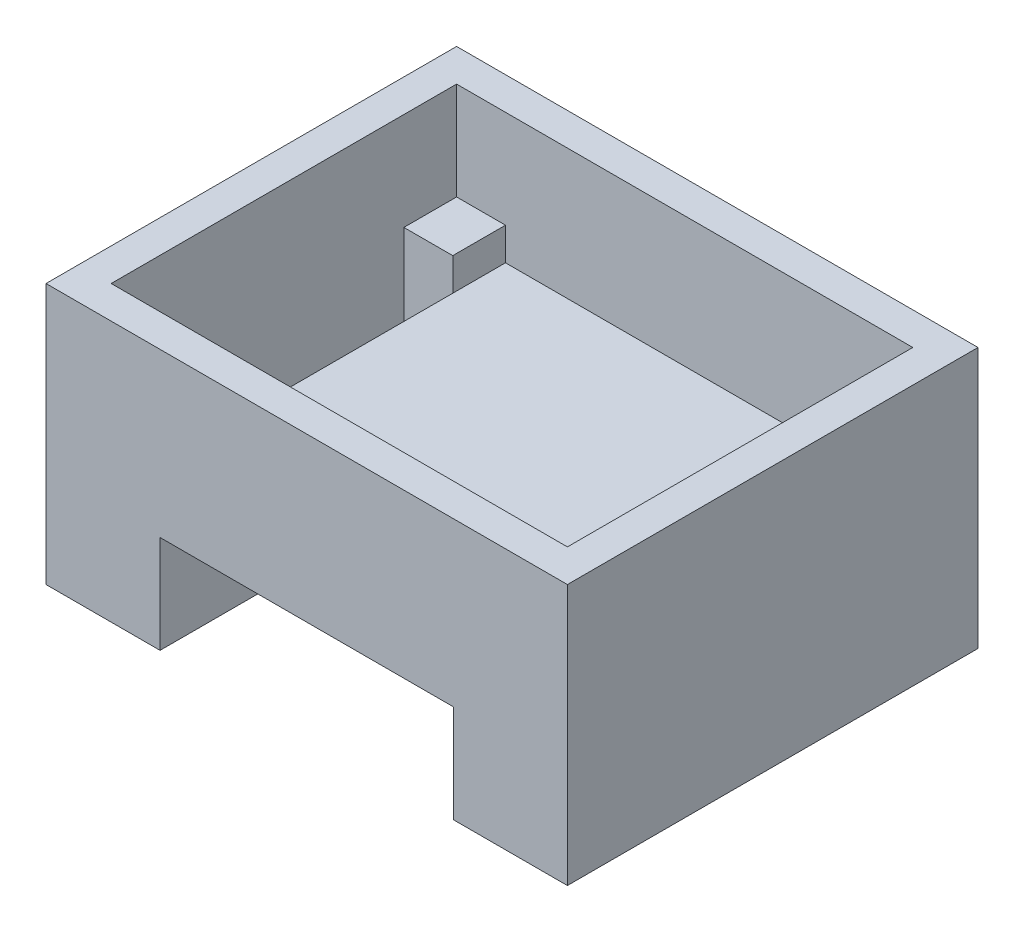
ISO-10303-21;
HEADER;
FILE_DESCRIPTION(('STEP AP214'),'2;1');
FILE_NAME('part.step','',(''),(''),'','','');
FILE_SCHEMA(('AUTOMOTIVE_DESIGN { 1 0 10303 214 1 1 1 1 }'));
ENDSEC;
DATA;
#1=APPLICATION_CONTEXT('core data for automotive mechanical design processes');
#2=APPLICATION_PROTOCOL_DEFINITION('international standard','automotive_design',2000,#1);
#3=PRODUCT_CONTEXT('',#1,'mechanical');
#4=PRODUCT('Part','Part','',(#3));
#5=PRODUCT_RELATED_PRODUCT_CATEGORY('part','',(#4));
#6=PRODUCT_DEFINITION_FORMATION('','',#4);
#7=PRODUCT_DEFINITION_CONTEXT('part definition',#1,'design');
#8=PRODUCT_DEFINITION('design','',#6,#7);
#9=PRODUCT_DEFINITION_SHAPE('','',#8);
#10=(LENGTH_UNIT() NAMED_UNIT(*) SI_UNIT(.MILLI.,.METRE.));
#11=(NAMED_UNIT(*) PLANE_ANGLE_UNIT() SI_UNIT($,.RADIAN.));
#12=(NAMED_UNIT(*) SI_UNIT($,.STERADIAN.) SOLID_ANGLE_UNIT());
#13=UNCERTAINTY_MEASURE_WITH_UNIT(LENGTH_MEASURE(1.E-05),#10,'distance_accuracy_value','');
#14=(GEOMETRIC_REPRESENTATION_CONTEXT(3) GLOBAL_UNCERTAINTY_ASSIGNED_CONTEXT((#13)) GLOBAL_UNIT_ASSIGNED_CONTEXT((#10,
#11,#12)) REPRESENTATION_CONTEXT('',''));
#15=CARTESIAN_POINT('',(0.,0.,0.));
#16=DIRECTION('',(0.,0.,1.));
#17=DIRECTION('',(1.,0.,0.));
#18=AXIS2_PLACEMENT_3D('',#15,#16,#17);
#19=CARTESIAN_POINT('',(-65.,10.,-111.));
#20=DIRECTION('',(0.,1.,0.));
#21=DIRECTION('',(0.,0.,1.));
#22=AXIS2_PLACEMENT_3D('',#19,#20,#21);
#23=PLANE('',#22);
#24=DIRECTION('',(0.,0.,-1.));
#25=VECTOR('',#24,1.);
#26=CARTESIAN_POINT('',(-70.,10.,-126.));
#27=LINE('',#26,#25);
#28=CARTESIAN_POINT('',(-70.,10.,-99.8196601125011));
#29=VERTEX_POINT('',#28);
#30=CARTESIAN_POINT('',(-70.,10.,-116.));
#31=VERTEX_POINT('',#30);
#32=EDGE_CURVE('E271',#29,#31,#27,.T.);
#33=ORIENTED_EDGE('',*,*,#32,.F.);
#34=DIRECTION('',(-1.,0.,0.));
#35=VECTOR('',#34,1.);
#36=CARTESIAN_POINT('',(-70.,10.,-99.8196601125011));
#37=LINE('',#36,#35);
#38=CARTESIAN_POINT('',(-55.,10.,-99.8196601125011));
#39=VERTEX_POINT('',#38);
#40=EDGE_CURVE('E431',#39,#29,#37,.T.);
#41=ORIENTED_EDGE('',*,*,#40,.F.);
#42=DIRECTION('',(0.,0.,1.));
#43=VECTOR('',#42,1.);
#44=CARTESIAN_POINT('',(-55.,10.,-10.));
#45=LINE('',#44,#43);
#46=CARTESIAN_POINT('',(-55.,10.,-116.));
#47=VERTEX_POINT('',#46);
#48=EDGE_CURVE('E420',#47,#39,#45,.T.);
#49=ORIENTED_EDGE('',*,*,#48,.F.);
#50=DIRECTION('',(-1.,0.,0.));
#51=VECTOR('',#50,1.);
#52=CARTESIAN_POINT('',(-65.,10.,-116.));
#53=LINE('',#52,#51);
#54=EDGE_CURVE('E276',#47,#31,#53,.T.);
#55=ORIENTED_EDGE('',*,*,#54,.T.);
#56=EDGE_LOOP('',(#33,#41,#49,#55));
#57=FACE_BOUND('',#56,.T.);
#58=ADVANCED_FACE('F32',(#57),#23,.T.);
#59=CARTESIAN_POINT('',(-65.,10.,-15.));
#60=DIRECTION('',(0.,-1.,0.));
#61=DIRECTION('',(0.,0.,-1.));
#62=AXIS2_PLACEMENT_3D('',#59,#60,#61);
#63=PLANE('',#62);
#64=DIRECTION('',(-1.,0.,0.));
#65=VECTOR('',#64,1.);
#66=CARTESIAN_POINT('',(-55.,10.,-26.1803398874989));
#67=LINE('',#66,#65);
#68=CARTESIAN_POINT('',(-55.,10.,-26.1803398874989));
#69=VERTEX_POINT('',#68);
#70=CARTESIAN_POINT('',(-70.,10.,-26.1803398874989));
#71=VERTEX_POINT('',#70);
#72=EDGE_CURVE('E433',#69,#71,#67,.T.);
#73=ORIENTED_EDGE('',*,*,#72,.T.);
#74=DIRECTION('',(0.,0.,1.));
#75=VECTOR('',#74,1.);
#76=CARTESIAN_POINT('',(-70.,10.,-126.));
#77=LINE('',#76,#75);
#78=CARTESIAN_POINT('',(-70.,10.,-9.99999999999999));
#79=VERTEX_POINT('',#78);
#80=EDGE_CURVE('E232',#71,#79,#77,.T.);
#81=ORIENTED_EDGE('',*,*,#80,.T.);
#82=DIRECTION('',(1.,0.,0.));
#83=VECTOR('',#82,1.);
#84=CARTESIAN_POINT('',(-65.,10.,-10.));
#85=LINE('',#84,#83);
#86=CARTESIAN_POINT('',(-55.,10.,-10.));
#87=VERTEX_POINT('',#86);
#88=EDGE_CURVE('E273',#79,#87,#85,.T.);
#89=ORIENTED_EDGE('',*,*,#88,.T.);
#90=EDGE_CURVE('E428',#69,#87,#45,.T.);
#91=ORIENTED_EDGE('',*,*,#90,.F.);
#92=EDGE_LOOP('',(#73,#81,#89,#91));
#93=FACE_BOUND('',#92,.T.);
#94=ADVANCED_FACE('F480',(#93),#63,.F.);
#95=CARTESIAN_POINT('',(65.,10.,-15.));
#96=DIRECTION('',(0.,1.,0.));
#97=DIRECTION('',(0.,0.,1.));
#98=AXIS2_PLACEMENT_3D('',#95,#96,#97);
#99=PLANE('',#98);
#100=DIRECTION('',(-1.,0.,0.));
#101=VECTOR('',#100,1.);
#102=CARTESIAN_POINT('',(55.,10.,-26.1803398874989));
#103=LINE('',#102,#101);
#104=CARTESIAN_POINT('',(70.,10.,-26.1803398874989));
#105=VERTEX_POINT('',#104);
#106=CARTESIAN_POINT('',(55.,10.,-26.180339887499));
#107=VERTEX_POINT('',#106);
#108=EDGE_CURVE('E447',#105,#107,#103,.T.);
#109=ORIENTED_EDGE('',*,*,#108,.T.);
#110=DIRECTION('',(0.,0.,-1.));
#111=VECTOR('',#110,1.);
#112=CARTESIAN_POINT('',(55.,10.,-10.));
#113=LINE('',#112,#111);
#114=CARTESIAN_POINT('',(55.,10.,-10.));
#115=VERTEX_POINT('',#114);
#116=EDGE_CURVE('E423',#115,#107,#113,.T.);
#117=ORIENTED_EDGE('',*,*,#116,.F.);
#118=DIRECTION('',(-1.,0.,0.));
#119=VECTOR('',#118,1.);
#120=CARTESIAN_POINT('',(65.,10.,-10.));
#121=LINE('',#120,#119);
#122=CARTESIAN_POINT('',(70.,10.,-9.99999999999999));
#123=VERTEX_POINT('',#122);
#124=EDGE_CURVE('E281',#123,#115,#121,.T.);
#125=ORIENTED_EDGE('',*,*,#124,.F.);
#126=DIRECTION('',(0.,0.,1.));
#127=VECTOR('',#126,1.);
#128=CARTESIAN_POINT('',(70.,10.,-126.));
#129=LINE('',#128,#127);
#130=EDGE_CURVE('E279',#105,#123,#129,.T.);
#131=ORIENTED_EDGE('',*,*,#130,.F.);
#132=EDGE_LOOP('',(#109,#117,#125,#131));
#133=FACE_BOUND('',#132,.T.);
#134=ADVANCED_FACE('F468',(#133),#99,.T.);
#135=CARTESIAN_POINT('',(65.,10.,-111.));
#136=DIRECTION('',(0.,-1.,0.));
#137=DIRECTION('',(0.,0.,-1.));
#138=AXIS2_PLACEMENT_3D('',#135,#136,#137);
#139=PLANE('',#138);
#140=DIRECTION('',(0.,0.,-1.));
#141=VECTOR('',#140,1.);
#142=CARTESIAN_POINT('',(55.,10.,-111.));
#143=LINE('',#142,#141);
#144=CARTESIAN_POINT('',(55.,10.,-99.8196601125011));
#145=VERTEX_POINT('',#144);
#146=CARTESIAN_POINT('',(55.,10.,-116.));
#147=VERTEX_POINT('',#146);
#148=EDGE_CURVE('E40',#145,#147,#143,.T.);
#149=ORIENTED_EDGE('',*,*,#148,.F.);
#150=DIRECTION('',(-1.,0.,0.));
#151=VECTOR('',#150,1.);
#152=CARTESIAN_POINT('',(70.,10.,-99.8196601125011));
#153=LINE('',#152,#151);
#154=CARTESIAN_POINT('',(70.,10.,-99.8196601125011));
#155=VERTEX_POINT('',#154);
#156=EDGE_CURVE('E211',#155,#145,#153,.T.);
#157=ORIENTED_EDGE('',*,*,#156,.F.);
#158=DIRECTION('',(0.,0.,1.));
#159=VECTOR('',#158,1.);
#160=CARTESIAN_POINT('',(70.,10.,-111.));
#161=LINE('',#160,#159);
#162=CARTESIAN_POINT('',(70.,10.,-116.));
#163=VERTEX_POINT('',#162);
#164=EDGE_CURVE('E286',#163,#155,#161,.T.);
#165=ORIENTED_EDGE('',*,*,#164,.F.);
#166=DIRECTION('',(1.,0.,0.));
#167=VECTOR('',#166,1.);
#168=CARTESIAN_POINT('',(65.,10.,-116.));
#169=LINE('',#168,#167);
#170=EDGE_CURVE('E284',#147,#163,#169,.T.);
#171=ORIENTED_EDGE('',*,*,#170,.F.);
#172=EDGE_LOOP('',(#149,#157,#165,#171));
#173=FACE_BOUND('',#172,.T.);
#174=ADVANCED_FACE('F375',(#173),#139,.F.);
#175=CARTESIAN_POINT('',(-80.,40.,-126.));
#176=DIRECTION('',(0.,1.,0.));
#177=DIRECTION('',(0.,0.,1.));
#178=AXIS2_PLACEMENT_3D('',#175,#176,#177);
#179=PLANE('',#178);
#180=DIRECTION('',(-1.,0.,0.));
#181=VECTOR('',#180,1.);
#182=CARTESIAN_POINT('',(-80.,40.,0.));
#183=LINE('',#182,#181);
#184=CARTESIAN_POINT('',(80.,40.,0.));
#185=VERTEX_POINT('',#184);
#186=CARTESIAN_POINT('',(-80.,40.,0.));
#187=VERTEX_POINT('',#186);
#188=EDGE_CURVE('E353',#185,#187,#183,.T.);
#189=ORIENTED_EDGE('',*,*,#188,.F.);
#190=DIRECTION('',(0.,0.,1.));
#191=VECTOR('',#190,1.);
#192=CARTESIAN_POINT('',(80.,40.,-126.));
#193=LINE('',#192,#191);
#194=CARTESIAN_POINT('',(80.,40.,-126.));
#195=VERTEX_POINT('',#194);
#196=EDGE_CURVE('E350',#195,#185,#193,.T.);
#197=ORIENTED_EDGE('',*,*,#196,.F.);
#198=DIRECTION('',(-1.,0.,0.));
#199=VECTOR('',#198,1.);
#200=CARTESIAN_POINT('',(-80.,40.,-126.));
#201=LINE('',#200,#199);
#202=CARTESIAN_POINT('',(-80.,40.,-126.));
#203=VERTEX_POINT('',#202);
#204=EDGE_CURVE('E339',#195,#203,#201,.T.);
#205=ORIENTED_EDGE('',*,*,#204,.T.);
#206=DIRECTION('',(0.,0.,1.));
#207=VECTOR('',#206,1.);
#208=CARTESIAN_POINT('',(-80.,40.,-126.));
#209=LINE('',#208,#207);
#210=EDGE_CURVE('E368',#203,#187,#209,.T.);
#211=ORIENTED_EDGE('',*,*,#210,.T.);
#212=EDGE_LOOP('',(#189,#197,#205,#211));
#213=FACE_BOUND('',#212,.T.);
#214=DIRECTION('',(0.,0.,1.));
#215=VECTOR('',#214,1.);
#216=CARTESIAN_POINT('',(70.,40.,-126.));
#217=LINE('',#216,#215);
#218=CARTESIAN_POINT('',(70.,40.,-116.));
#219=VERTEX_POINT('',#218);
#220=CARTESIAN_POINT('',(70.,40.,-10.));
#221=VERTEX_POINT('',#220);
#222=EDGE_CURVE('E249',#219,#221,#217,.T.);
#223=ORIENTED_EDGE('',*,*,#222,.T.);
#224=DIRECTION('',(-1.,0.,0.));
#225=VECTOR('',#224,1.);
#226=CARTESIAN_POINT('',(-80.,40.,-9.99999999999999));
#227=LINE('',#226,#225);
#228=CARTESIAN_POINT('',(-70.,40.,-10.));
#229=VERTEX_POINT('',#228);
#230=EDGE_CURVE('E258',#221,#229,#227,.T.);
#231=ORIENTED_EDGE('',*,*,#230,.T.);
#232=DIRECTION('',(0.,0.,1.));
#233=VECTOR('',#232,1.);
#234=CARTESIAN_POINT('',(-70.,40.,-126.));
#235=LINE('',#234,#233);
#236=CARTESIAN_POINT('',(-70.,40.,-116.));
#237=VERTEX_POINT('',#236);
#238=EDGE_CURVE('E252',#237,#229,#235,.T.);
#239=ORIENTED_EDGE('',*,*,#238,.F.);
#240=DIRECTION('',(-1.,0.,0.));
#241=VECTOR('',#240,1.);
#242=CARTESIAN_POINT('',(-80.,40.,-116.));
#243=LINE('',#242,#241);
#244=EDGE_CURVE('E54',#219,#237,#243,.T.);
#245=ORIENTED_EDGE('',*,*,#244,.F.);
#246=EDGE_LOOP('',(#223,#231,#239,#245));
#247=FACE_BOUND('',#246,.T.);
#248=ADVANCED_FACE('F388',(#213,#247),#179,.T.);
#249=CARTESIAN_POINT('',(-80.,-40.,-126.));
#250=DIRECTION('',(0.,-1.,0.));
#251=DIRECTION('',(0.,0.,-1.));
#252=AXIS2_PLACEMENT_3D('',#249,#250,#251);
#253=PLANE('',#252);
#254=CARTESIAN_POINT('',(65.,-40.,-111.));
#255=DIRECTION('',(0.,-1.,0.));
#256=DIRECTION('',(0.,0.,-1.));
#257=AXIS2_PLACEMENT_3D('',#254,#255,#256);
#258=CIRCLE('',#257,5.00000000000001);
#259=CARTESIAN_POINT('',(65.,-40.,-116.));
#260=VERTEX_POINT('',#259);
#261=EDGE_CURVE('E300',#260,#260,#258,.T.);
#262=ORIENTED_EDGE('',*,*,#261,.F.);
#263=EDGE_LOOP('',(#262));
#264=FACE_BOUND('',#263,.T.);
#265=CARTESIAN_POINT('',(65.,-40.,-15.));
#266=DIRECTION('',(0.,-1.,0.));
#267=DIRECTION('',(0.,0.,1.));
#268=AXIS2_PLACEMENT_3D('',#265,#266,#267);
#269=CIRCLE('',#268,5.00000000000001);
#270=CARTESIAN_POINT('',(65.,-40.,-10.));
#271=VERTEX_POINT('',#270);
#272=EDGE_CURVE('E294',#271,#271,#269,.T.);
#273=ORIENTED_EDGE('',*,*,#272,.F.);
#274=EDGE_LOOP('',(#273));
#275=FACE_BOUND('',#274,.T.);
#276=DIRECTION('',(0.,0.,1.));
#277=VECTOR('',#276,1.);
#278=CARTESIAN_POINT('',(45.,-40.,-126.));
#279=LINE('',#278,#277);
#280=CARTESIAN_POINT('',(45.,-40.,-126.));
#281=VERTEX_POINT('',#280);
#282=CARTESIAN_POINT('',(45.,-40.,0.));
#283=VERTEX_POINT('',#282);
#284=EDGE_CURVE('E333',#281,#283,#279,.T.);
#285=ORIENTED_EDGE('',*,*,#284,.F.);
#286=DIRECTION('',(1.,0.,0.));
#287=VECTOR('',#286,1.);
#288=CARTESIAN_POINT('',(-80.,-40.,-126.));
#289=LINE('',#288,#287);
#290=CARTESIAN_POINT('',(80.,-40.,-126.));
#291=VERTEX_POINT('',#290);
#292=EDGE_CURVE('E346',#281,#291,#289,.T.);
#293=ORIENTED_EDGE('',*,*,#292,.T.);
#294=DIRECTION('',(0.,0.,1.));
#295=VECTOR('',#294,1.);
#296=CARTESIAN_POINT('',(80.,-40.,-126.));
#297=LINE('',#296,#295);
#298=CARTESIAN_POINT('',(80.,-40.,0.));
#299=VERTEX_POINT('',#298);
#300=EDGE_CURVE('E362',#291,#299,#297,.T.);
#301=ORIENTED_EDGE('',*,*,#300,.T.);
#302=DIRECTION('',(1.,0.,0.));
#303=VECTOR('',#302,1.);
#304=CARTESIAN_POINT('',(-80.,-40.,0.));
#305=LINE('',#304,#303);
#306=EDGE_CURVE('E359',#283,#299,#305,.T.);
#307=ORIENTED_EDGE('',*,*,#306,.F.);
#308=EDGE_LOOP('',(#285,#293,#301,#307));
#309=FACE_BOUND('',#308,.T.);
#310=ADVANCED_FACE('F570',(#264,#275,#309),#253,.T.);
#311=CARTESIAN_POINT('',(80.,-40.,-126.));
#312=DIRECTION('',(1.,0.,0.));
#313=DIRECTION('',(0.,0.,-1.));
#314=AXIS2_PLACEMENT_3D('',#311,#312,#313);
#315=PLANE('',#314);
#316=DIRECTION('',(0.,1.,0.));
#317=VECTOR('',#316,1.);
#318=CARTESIAN_POINT('',(80.,-40.,0.));
#319=LINE('',#318,#317);
#320=EDGE_CURVE('E335',#299,#185,#319,.T.);
#321=ORIENTED_EDGE('',*,*,#320,.F.);
#322=ORIENTED_EDGE('',*,*,#300,.F.);
#323=DIRECTION('',(0.,1.,0.));
#324=VECTOR('',#323,1.);
#325=CARTESIAN_POINT('',(80.,-40.,-126.));
#326=LINE('',#325,#324);
#327=EDGE_CURVE('E336',#291,#195,#326,.T.);
#328=ORIENTED_EDGE('',*,*,#327,.T.);
#329=ORIENTED_EDGE('',*,*,#196,.T.);
#330=EDGE_LOOP('',(#321,#322,#328,#329));
#331=FACE_BOUND('',#330,.T.);
#332=ADVANCED_FACE('F34',(#331),#315,.T.);
#333=CARTESIAN_POINT('',(-65.,-40.,-111.));
#334=DIRECTION('',(0.,-1.,0.));
#335=DIRECTION('',(0.,0.,1.));
#336=AXIS2_PLACEMENT_3D('',#333,#334,#335);
#337=CIRCLE('',#336,5.00000000000001);
#338=CARTESIAN_POINT('',(-65.,-40.,-106.));
#339=VERTEX_POINT('',#338);
#340=EDGE_CURVE('E289',#339,#339,#337,.T.);
#341=ORIENTED_EDGE('',*,*,#340,.F.);
#342=EDGE_LOOP('',(#341));
#343=FACE_BOUND('',#342,.T.);
#344=CARTESIAN_POINT('',(-65.,-40.,-15.));
#345=DIRECTION('',(0.,-1.,0.));
#346=DIRECTION('',(0.,0.,-1.));
#347=AXIS2_PLACEMENT_3D('',#344,#345,#346);
#348=CIRCLE('',#347,5.);
#349=CARTESIAN_POINT('',(-65.,-40.,-20.));
#350=VERTEX_POINT('',#349);
#351=EDGE_CURVE('E293',#350,#350,#348,.T.);
#352=ORIENTED_EDGE('',*,*,#351,.F.);
#353=EDGE_LOOP('',(#352));
#354=FACE_BOUND('',#353,.T.);
#355=DIRECTION('',(0.,0.,-1.));
#356=VECTOR('',#355,1.);
#357=CARTESIAN_POINT('',(-45.,-40.,-126.));
#358=LINE('',#357,#356);
#359=CARTESIAN_POINT('',(-45.,-40.,0.));
#360=VERTEX_POINT('',#359);
#361=CARTESIAN_POINT('',(-45.,-40.,-126.));
#362=VERTEX_POINT('',#361);
#363=EDGE_CURVE('E330',#360,#362,#358,.T.);
#364=ORIENTED_EDGE('',*,*,#363,.F.);
#365=CARTESIAN_POINT('',(-80.,-40.,0.));
#366=VERTEX_POINT('',#365);
#367=EDGE_CURVE('E340',#366,#360,#305,.T.);
#368=ORIENTED_EDGE('',*,*,#367,.F.);
#369=DIRECTION('',(0.,0.,1.));
#370=VECTOR('',#369,1.);
#371=CARTESIAN_POINT('',(-80.,-40.,-126.));
#372=LINE('',#371,#370);
#373=CARTESIAN_POINT('',(-80.,-40.,-126.));
#374=VERTEX_POINT('',#373);
#375=EDGE_CURVE('E366',#374,#366,#372,.T.);
#376=ORIENTED_EDGE('',*,*,#375,.F.);
#377=EDGE_CURVE('E347',#374,#362,#289,.T.);
#378=ORIENTED_EDGE('',*,*,#377,.T.);
#379=EDGE_LOOP('',(#364,#368,#376,#378));
#380=FACE_BOUND('',#379,.T.);
#381=ADVANCED_FACE('F566',(#343,#354,#380),#253,.T.);
#382=CARTESIAN_POINT('',(-80.,-40.,-126.));
#383=DIRECTION('',(-1.,0.,0.));
#384=DIRECTION('',(0.,0.,1.));
#385=AXIS2_PLACEMENT_3D('',#382,#383,#384);
#386=PLANE('',#385);
#387=DIRECTION('',(0.,-1.,0.));
#388=VECTOR('',#387,1.);
#389=CARTESIAN_POINT('',(-80.,-40.,0.));
#390=LINE('',#389,#388);
#391=EDGE_CURVE('E356',#187,#366,#390,.T.);
#392=ORIENTED_EDGE('',*,*,#391,.F.);
#393=ORIENTED_EDGE('',*,*,#210,.F.);
#394=DIRECTION('',(0.,-1.,0.));
#395=VECTOR('',#394,1.);
#396=CARTESIAN_POINT('',(-80.,-40.,-126.));
#397=LINE('',#396,#395);
#398=EDGE_CURVE('E343',#203,#374,#397,.T.);
#399=ORIENTED_EDGE('',*,*,#398,.T.);
#400=ORIENTED_EDGE('',*,*,#375,.T.);
#401=EDGE_LOOP('',(#392,#393,#399,#400));
#402=FACE_BOUND('',#401,.T.);
#403=ADVANCED_FACE('F561',(#402),#386,.T.);
#404=CARTESIAN_POINT('',(0.,0.,-126.));
#405=DIRECTION('',(0.,0.,-1.));
#406=DIRECTION('',(-1.,0.,0.));
#407=AXIS2_PLACEMENT_3D('',#404,#405,#406);
#408=PLANE('',#407);
#409=DIRECTION('',(0.,1.,0.));
#410=VECTOR('',#409,1.);
#411=CARTESIAN_POINT('',(45.,-70.,-126.));
#412=LINE('',#411,#410);
#413=CARTESIAN_POINT('',(45.,-10.,-126.));
#414=VERTEX_POINT('',#413);
#415=EDGE_CURVE('E314',#281,#414,#412,.T.);
#416=ORIENTED_EDGE('',*,*,#415,.T.);
#417=DIRECTION('',(-1.,0.,0.));
#418=VECTOR('',#417,1.);
#419=CARTESIAN_POINT('',(-45.,-10.,-126.));
#420=LINE('',#419,#418);
#421=CARTESIAN_POINT('',(-45.,-10.,-126.));
#422=VERTEX_POINT('',#421);
#423=EDGE_CURVE('E317',#414,#422,#420,.T.);
#424=ORIENTED_EDGE('',*,*,#423,.T.);
#425=DIRECTION('',(0.,-1.,0.));
#426=VECTOR('',#425,1.);
#427=CARTESIAN_POINT('',(-45.,-70.,-126.));
#428=LINE('',#427,#426);
#429=EDGE_CURVE('E321',#422,#362,#428,.T.);
#430=ORIENTED_EDGE('',*,*,#429,.T.);
#431=ORIENTED_EDGE('',*,*,#377,.F.);
#432=ORIENTED_EDGE('',*,*,#398,.F.);
#433=ORIENTED_EDGE('',*,*,#204,.F.);
#434=ORIENTED_EDGE('',*,*,#327,.F.);
#435=ORIENTED_EDGE('',*,*,#292,.F.);
#436=EDGE_LOOP('',(#416,#424,#430,#431,#432,#433,#434,#435));
#437=FACE_BOUND('',#436,.T.);
#438=ADVANCED_FACE('F558',(#437),#408,.T.);
#439=CARTESIAN_POINT('',(0.,0.,0.));
#440=DIRECTION('',(0.,0.,-1.));
#441=DIRECTION('',(-1.,0.,0.));
#442=AXIS2_PLACEMENT_3D('',#439,#440,#441);
#443=PLANE('',#442);
#444=DIRECTION('',(-1.,0.,0.));
#445=VECTOR('',#444,1.);
#446=CARTESIAN_POINT('',(-45.,-10.,0.));
#447=LINE('',#446,#445);
#448=CARTESIAN_POINT('',(45.,-10.,0.));
#449=VERTEX_POINT('',#448);
#450=CARTESIAN_POINT('',(-45.,-10.,0.));
#451=VERTEX_POINT('',#450);
#452=EDGE_CURVE('E311',#449,#451,#447,.T.);
#453=ORIENTED_EDGE('',*,*,#452,.F.);
#454=DIRECTION('',(0.,-1.,0.));
#455=VECTOR('',#454,1.);
#456=CARTESIAN_POINT('',(45.,0.,0.));
#457=LINE('',#456,#455);
#458=EDGE_CURVE('E365',#449,#283,#457,.T.);
#459=ORIENTED_EDGE('',*,*,#458,.T.);
#460=ORIENTED_EDGE('',*,*,#306,.T.);
#461=ORIENTED_EDGE('',*,*,#320,.T.);
#462=ORIENTED_EDGE('',*,*,#188,.T.);
#463=ORIENTED_EDGE('',*,*,#391,.T.);
#464=ORIENTED_EDGE('',*,*,#367,.T.);
#465=DIRECTION('',(0.,-1.,0.));
#466=VECTOR('',#465,1.);
#467=CARTESIAN_POINT('',(-45.,-70.,0.));
#468=LINE('',#467,#466);
#469=EDGE_CURVE('E318',#451,#360,#468,.T.);
#470=ORIENTED_EDGE('',*,*,#469,.F.);
#471=EDGE_LOOP('',(#453,#459,#460,#461,#462,#463,#464,#470));
#472=FACE_BOUND('',#471,.T.);
#473=ADVANCED_FACE('F556',(#472),#443,.F.);
#474=CARTESIAN_POINT('',(45.,-70.,-126.));
#475=DIRECTION('',(1.,0.,0.));
#476=DIRECTION('',(0.,0.,-1.));
#477=AXIS2_PLACEMENT_3D('',#474,#475,#476);
#478=PLANE('',#477);
#479=ORIENTED_EDGE('',*,*,#284,.T.);
#480=ORIENTED_EDGE('',*,*,#458,.F.);
#481=DIRECTION('',(0.,0.,1.));
#482=VECTOR('',#481,1.);
#483=CARTESIAN_POINT('',(45.,-10.,-126.));
#484=LINE('',#483,#482);
#485=EDGE_CURVE('E324',#414,#449,#484,.T.);
#486=ORIENTED_EDGE('',*,*,#485,.F.);
#487=ORIENTED_EDGE('',*,*,#415,.F.);
#488=EDGE_LOOP('',(#479,#480,#486,#487));
#489=FACE_BOUND('',#488,.T.);
#490=ADVANCED_FACE('F549',(#489),#478,.F.);
#491=CARTESIAN_POINT('',(-45.,-70.,-126.));
#492=DIRECTION('',(-1.,0.,0.));
#493=DIRECTION('',(0.,0.,1.));
#494=AXIS2_PLACEMENT_3D('',#491,#492,#493);
#495=PLANE('',#494);
#496=ORIENTED_EDGE('',*,*,#363,.T.);
#497=ORIENTED_EDGE('',*,*,#429,.F.);
#498=DIRECTION('',(0.,0.,1.));
#499=VECTOR('',#498,1.);
#500=CARTESIAN_POINT('',(-45.,-10.,-126.));
#501=LINE('',#500,#499);
#502=EDGE_CURVE('E328',#422,#451,#501,.T.);
#503=ORIENTED_EDGE('',*,*,#502,.T.);
#504=ORIENTED_EDGE('',*,*,#469,.T.);
#505=EDGE_LOOP('',(#496,#497,#503,#504));
#506=FACE_BOUND('',#505,.T.);
#507=ADVANCED_FACE('F546',(#506),#495,.F.);
#508=CARTESIAN_POINT('',(-45.,-10.,-126.));
#509=DIRECTION('',(0.,1.,0.));
#510=DIRECTION('',(0.,0.,1.));
#511=AXIS2_PLACEMENT_3D('',#508,#509,#510);
#512=PLANE('',#511);
#513=ORIENTED_EDGE('',*,*,#452,.T.);
#514=ORIENTED_EDGE('',*,*,#502,.F.);
#515=ORIENTED_EDGE('',*,*,#423,.F.);
#516=ORIENTED_EDGE('',*,*,#485,.T.);
#517=EDGE_LOOP('',(#513,#514,#515,#516));
#518=FACE_BOUND('',#517,.T.);
#519=ADVANCED_FACE('F544',(#518),#512,.F.);
#520=CARTESIAN_POINT('',(-65.,0.,-15.));
#521=DIRECTION('',(0.,-1.,0.));
#522=DIRECTION('',(0.,0.,-1.));
#523=AXIS2_PLACEMENT_3D('',#520,#521,#522);
#524=CYLINDRICAL_SURFACE('',#523,5.);
#525=CARTESIAN_POINT('',(-65.,0.,-15.));
#526=DIRECTION('',(0.,-1.,0.));
#527=DIRECTION('',(0.,0.,-1.));
#528=AXIS2_PLACEMENT_3D('',#525,#526,#527);
#529=CIRCLE('',#528,5.);
#530=CARTESIAN_POINT('',(-65.,0.,-20.));
#531=VERTEX_POINT('',#530);
#532=EDGE_CURVE('E308',#531,#531,#529,.T.);
#533=ORIENTED_EDGE('',*,*,#532,.F.);
#534=EDGE_LOOP('',(#533));
#535=FACE_BOUND('',#534,.T.);
#536=ORIENTED_EDGE('',*,*,#351,.T.);
#537=EDGE_LOOP('',(#536));
#538=FACE_BOUND('',#537,.T.);
#539=ADVANCED_FACE('F540',(#535,#538),#524,.F.);
#540=CARTESIAN_POINT('',(-65.,0.,-15.));
#541=DIRECTION('',(0.,-1.,0.));
#542=DIRECTION('',(0.,0.,-1.));
#543=AXIS2_PLACEMENT_3D('',#540,#541,#542);
#544=PLANE('',#543);
#545=ORIENTED_EDGE('',*,*,#532,.T.);
#546=EDGE_LOOP('',(#545));
#547=FACE_BOUND('',#546,.T.);
#548=ADVANCED_FACE('F536',(#547),#544,.T.);
#549=CARTESIAN_POINT('',(-65.,0.,-111.));
#550=DIRECTION('',(0.,-1.,0.));
#551=DIRECTION('',(0.,0.,-1.));
#552=AXIS2_PLACEMENT_3D('',#549,#550,#551);
#553=CYLINDRICAL_SURFACE('',#552,5.00000000000001);
#554=CARTESIAN_POINT('',(-65.,0.,-111.));
#555=DIRECTION('',(0.,-1.,0.));
#556=DIRECTION('',(0.,0.,1.));
#557=AXIS2_PLACEMENT_3D('',#554,#555,#556);
#558=CIRCLE('',#557,5.00000000000001);
#559=CARTESIAN_POINT('',(-65.,0.,-106.));
#560=VERTEX_POINT('',#559);
#561=EDGE_CURVE('E303',#560,#560,#558,.T.);
#562=ORIENTED_EDGE('',*,*,#561,.F.);
#563=EDGE_LOOP('',(#562));
#564=FACE_BOUND('',#563,.T.);
#565=ORIENTED_EDGE('',*,*,#340,.T.);
#566=EDGE_LOOP('',(#565));
#567=FACE_BOUND('',#566,.T.);
#568=ADVANCED_FACE('F532',(#564,#567),#553,.F.);
#569=CARTESIAN_POINT('',(-65.,0.,-111.));
#570=DIRECTION('',(0.,1.,0.));
#571=DIRECTION('',(0.,0.,1.));
#572=AXIS2_PLACEMENT_3D('',#569,#570,#571);
#573=PLANE('',#572);
#574=ORIENTED_EDGE('',*,*,#561,.T.);
#575=EDGE_LOOP('',(#574));
#576=FACE_BOUND('',#575,.T.);
#577=ADVANCED_FACE('F521',(#576),#573,.F.);
#578=CARTESIAN_POINT('',(65.,0.,-15.));
#579=DIRECTION('',(0.,-1.,0.));
#580=DIRECTION('',(0.,0.,-1.));
#581=AXIS2_PLACEMENT_3D('',#578,#579,#580);
#582=CYLINDRICAL_SURFACE('',#581,5.00000000000001);
#583=CARTESIAN_POINT('',(65.,0.,-15.));
#584=DIRECTION('',(0.,-1.,0.));
#585=DIRECTION('',(0.,0.,1.));
#586=AXIS2_PLACEMENT_3D('',#583,#584,#585);
#587=CIRCLE('',#586,5.00000000000001);
#588=CARTESIAN_POINT('',(65.,0.,-10.));
#589=VERTEX_POINT('',#588);
#590=EDGE_CURVE('E290',#589,#589,#587,.T.);
#591=ORIENTED_EDGE('',*,*,#590,.F.);
#592=EDGE_LOOP('',(#591));
#593=FACE_BOUND('',#592,.T.);
#594=ORIENTED_EDGE('',*,*,#272,.T.);
#595=EDGE_LOOP('',(#594));
#596=FACE_BOUND('',#595,.T.);
#597=ADVANCED_FACE('F517',(#593,#596),#582,.F.);
#598=CARTESIAN_POINT('',(65.,0.,-15.));
#599=DIRECTION('',(0.,1.,0.));
#600=DIRECTION('',(0.,0.,1.));
#601=AXIS2_PLACEMENT_3D('',#598,#599,#600);
#602=PLANE('',#601);
#603=ORIENTED_EDGE('',*,*,#590,.T.);
#604=EDGE_LOOP('',(#603));
#605=FACE_BOUND('',#604,.T.);
#606=ADVANCED_FACE('F513',(#605),#602,.F.);
#607=CARTESIAN_POINT('',(65.,0.,-111.));
#608=DIRECTION('',(0.,-1.,0.));
#609=DIRECTION('',(0.,0.,-1.));
#610=AXIS2_PLACEMENT_3D('',#607,#608,#609);
#611=CYLINDRICAL_SURFACE('',#610,5.00000000000001);
#612=CARTESIAN_POINT('',(65.,0.,-111.));
#613=DIRECTION('',(0.,-1.,0.));
#614=DIRECTION('',(0.,0.,-1.));
#615=AXIS2_PLACEMENT_3D('',#612,#613,#614);
#616=CIRCLE('',#615,5.00000000000001);
#617=CARTESIAN_POINT('',(65.,0.,-116.));
#618=VERTEX_POINT('',#617);
#619=EDGE_CURVE('E297',#618,#618,#616,.T.);
#620=ORIENTED_EDGE('',*,*,#619,.F.);
#621=EDGE_LOOP('',(#620));
#622=FACE_BOUND('',#621,.T.);
#623=ORIENTED_EDGE('',*,*,#261,.T.);
#624=EDGE_LOOP('',(#623));
#625=FACE_BOUND('',#624,.T.);
#626=ADVANCED_FACE('F516',(#622,#625),#611,.F.);
#627=CARTESIAN_POINT('',(65.,0.,-111.));
#628=DIRECTION('',(0.,-1.,0.));
#629=DIRECTION('',(0.,0.,-1.));
#630=AXIS2_PLACEMENT_3D('',#627,#628,#629);
#631=PLANE('',#630);
#632=ORIENTED_EDGE('',*,*,#619,.T.);
#633=EDGE_LOOP('',(#632));
#634=FACE_BOUND('',#633,.T.);
#635=ADVANCED_FACE('F523',(#634),#631,.T.);
#636=CARTESIAN_POINT('',(70.,-40.,-126.));
#637=DIRECTION('',(1.,0.,0.));
#638=DIRECTION('',(0.,0.,-1.));
#639=AXIS2_PLACEMENT_3D('',#636,#637,#638);
#640=PLANE('',#639);
#641=DIRECTION('',(0.,-1.,0.));
#642=VECTOR('',#641,1.);
#643=CARTESIAN_POINT('',(70.,40.001,-99.8196601125011));
#644=LINE('',#643,#642);
#645=CARTESIAN_POINT('',(70.,-30.,-99.8196601125011));
#646=VERTEX_POINT('',#645);
#647=EDGE_CURVE('E438',#155,#646,#644,.T.);
#648=ORIENTED_EDGE('',*,*,#647,.T.);
#649=DIRECTION('',(0.,0.,1.));
#650=VECTOR('',#649,1.);
#651=CARTESIAN_POINT('',(70.,-30.,-126.));
#652=LINE('',#651,#650);
#653=CARTESIAN_POINT('',(70.,-30.,-26.1803398874989));
#654=VERTEX_POINT('',#653);
#655=EDGE_CURVE('E267',#646,#654,#652,.T.);
#656=ORIENTED_EDGE('',*,*,#655,.T.);
#657=DIRECTION('',(0.,-1.,0.));
#658=VECTOR('',#657,1.);
#659=CARTESIAN_POINT('',(70.,40.001,-26.1803398874989));
#660=LINE('',#659,#658);
#661=EDGE_CURVE('E452',#105,#654,#660,.T.);
#662=ORIENTED_EDGE('',*,*,#661,.F.);
#663=ORIENTED_EDGE('',*,*,#130,.T.);
#664=DIRECTION('',(0.,1.,0.));
#665=VECTOR('',#664,1.);
#666=CARTESIAN_POINT('',(70.,-40.,-9.99999999999999));
#667=LINE('',#666,#665);
#668=EDGE_CURVE('E262',#123,#221,#667,.T.);
#669=ORIENTED_EDGE('',*,*,#668,.T.);
#670=ORIENTED_EDGE('',*,*,#222,.F.);
#671=DIRECTION('',(0.,1.,0.));
#672=VECTOR('',#671,1.);
#673=CARTESIAN_POINT('',(70.,-40.,-116.));
#674=LINE('',#673,#672);
#675=EDGE_CURVE('E255',#163,#219,#674,.T.);
#676=ORIENTED_EDGE('',*,*,#675,.F.);
#677=ORIENTED_EDGE('',*,*,#164,.T.);
#678=EDGE_LOOP('',(#648,#656,#662,#663,#669,#670,#676,#677));
#679=FACE_BOUND('',#678,.T.);
#680=ADVANCED_FACE('F383',(#679),#640,.F.);
#681=CARTESIAN_POINT('',(0.,0.,-116.));
#682=DIRECTION('',(0.,0.,-1.));
#683=DIRECTION('',(-1.,0.,0.));
#684=AXIS2_PLACEMENT_3D('',#681,#682,#683);
#685=PLANE('',#684);
#686=ORIENTED_EDGE('',*,*,#54,.F.);
#687=DIRECTION('',(0.,-1.,0.));
#688=VECTOR('',#687,1.);
#689=CARTESIAN_POINT('',(-55.,10.,-116.));
#690=LINE('',#689,#688);
#691=CARTESIAN_POINT('',(-55.,0.,-116.));
#692=VERTEX_POINT('',#691);
#693=EDGE_CURVE('E411',#47,#692,#690,.T.);
#694=ORIENTED_EDGE('',*,*,#693,.T.);
#695=DIRECTION('',(-1.,0.,0.));
#696=VECTOR('',#695,1.);
#697=CARTESIAN_POINT('',(-45.,0.,-116.));
#698=LINE('',#697,#696);
#699=CARTESIAN_POINT('',(55.,0.,-116.));
#700=VERTEX_POINT('',#699);
#701=EDGE_CURVE('E239',#700,#692,#698,.T.);
#702=ORIENTED_EDGE('',*,*,#701,.F.);
#703=DIRECTION('',(0.,-1.,0.));
#704=VECTOR('',#703,1.);
#705=CARTESIAN_POINT('',(55.,10.,-116.));
#706=LINE('',#705,#704);
#707=EDGE_CURVE('E47',#147,#700,#706,.T.);
#708=ORIENTED_EDGE('',*,*,#707,.F.);
#709=ORIENTED_EDGE('',*,*,#170,.T.);
#710=ORIENTED_EDGE('',*,*,#675,.T.);
#711=ORIENTED_EDGE('',*,*,#244,.T.);
#712=DIRECTION('',(0.,-1.,0.));
#713=VECTOR('',#712,1.);
#714=CARTESIAN_POINT('',(-70.,-40.,-116.));
#715=LINE('',#714,#713);
#716=EDGE_CURVE('E253',#237,#31,#715,.T.);
#717=ORIENTED_EDGE('',*,*,#716,.T.);
#718=EDGE_LOOP('',(#686,#694,#702,#708,#709,#710,#711,#717));
#719=FACE_BOUND('',#718,.T.);
#720=ADVANCED_FACE('F378',(#719),#685,.F.);
#721=CARTESIAN_POINT('',(-45.,0.,-126.));
#722=DIRECTION('',(0.,1.,0.));
#723=DIRECTION('',(0.,0.,1.));
#724=AXIS2_PLACEMENT_3D('',#721,#722,#723);
#725=PLANE('',#724);
#726=DIRECTION('',(0.,0.,1.));
#727=VECTOR('',#726,1.);
#728=CARTESIAN_POINT('',(55.,0.,-126.));
#729=LINE('',#728,#727);
#730=CARTESIAN_POINT('',(55.,0.,-99.8196601125011));
#731=VERTEX_POINT('',#730);
#732=CARTESIAN_POINT('',(55.,0.,-26.180339887499));
#733=VERTEX_POINT('',#732);
#734=EDGE_CURVE('E229',#731,#733,#729,.T.);
#735=ORIENTED_EDGE('',*,*,#734,.F.);
#736=DIRECTION('',(0.,0.,-1.));
#737=VECTOR('',#736,1.);
#738=CARTESIAN_POINT('',(55.,0.,-10.));
#739=LINE('',#738,#737);
#740=EDGE_CURVE('E217',#731,#700,#739,.T.);
#741=ORIENTED_EDGE('',*,*,#740,.T.);
#742=ORIENTED_EDGE('',*,*,#701,.T.);
#743=DIRECTION('',(0.,0.,1.));
#744=VECTOR('',#743,1.);
#745=CARTESIAN_POINT('',(-55.,0.,-10.));
#746=LINE('',#745,#744);
#747=CARTESIAN_POINT('',(-55.,0.,-99.8196601125011));
#748=VERTEX_POINT('',#747);
#749=EDGE_CURVE('E421',#692,#748,#746,.T.);
#750=ORIENTED_EDGE('',*,*,#749,.T.);
#751=DIRECTION('',(0.,0.,1.));
#752=VECTOR('',#751,1.);
#753=CARTESIAN_POINT('',(-55.,0.,-126.));
#754=LINE('',#753,#752);
#755=CARTESIAN_POINT('',(-55.,0.,-26.1803398874989));
#756=VERTEX_POINT('',#755);
#757=EDGE_CURVE('E238',#748,#756,#754,.T.);
#758=ORIENTED_EDGE('',*,*,#757,.T.);
#759=CARTESIAN_POINT('',(-55.,0.,-10.));
#760=VERTEX_POINT('',#759);
#761=EDGE_CURVE('E424',#756,#760,#746,.T.);
#762=ORIENTED_EDGE('',*,*,#761,.T.);
#763=DIRECTION('',(-1.,0.,0.));
#764=VECTOR('',#763,1.);
#765=CARTESIAN_POINT('',(-45.,0.,-9.99999999999999));
#766=LINE('',#765,#764);
#767=CARTESIAN_POINT('',(55.,0.,-10.));
#768=VERTEX_POINT('',#767);
#769=EDGE_CURVE('E244',#768,#760,#766,.T.);
#770=ORIENTED_EDGE('',*,*,#769,.F.);
#771=EDGE_CURVE('E221',#768,#733,#739,.T.);
#772=ORIENTED_EDGE('',*,*,#771,.T.);
#773=EDGE_LOOP('',(#735,#741,#742,#750,#758,#762,#770,#772));
#774=FACE_BOUND('',#773,.T.);
#775=ADVANCED_FACE('F236',(#774),#725,.T.);
#776=CARTESIAN_POINT('',(0.,0.,-10.));
#777=DIRECTION('',(0.,0.,-1.));
#778=DIRECTION('',(-1.,0.,0.));
#779=AXIS2_PLACEMENT_3D('',#776,#777,#778);
#780=PLANE('',#779);
#781=DIRECTION('',(0.,-1.,0.));
#782=VECTOR('',#781,1.);
#783=CARTESIAN_POINT('',(-55.,10.,-10.));
#784=LINE('',#783,#782);
#785=EDGE_CURVE('E414',#87,#760,#784,.T.);
#786=ORIENTED_EDGE('',*,*,#785,.F.);
#787=ORIENTED_EDGE('',*,*,#88,.F.);
#788=DIRECTION('',(0.,-1.,0.));
#789=VECTOR('',#788,1.);
#790=CARTESIAN_POINT('',(-70.,-40.,-9.99999999999999));
#791=LINE('',#790,#789);
#792=EDGE_CURVE('E261',#229,#79,#791,.T.);
#793=ORIENTED_EDGE('',*,*,#792,.F.);
#794=ORIENTED_EDGE('',*,*,#230,.F.);
#795=ORIENTED_EDGE('',*,*,#668,.F.);
#796=ORIENTED_EDGE('',*,*,#124,.T.);
#797=DIRECTION('',(0.,-1.,0.));
#798=VECTOR('',#797,1.);
#799=CARTESIAN_POINT('',(55.,10.,-10.));
#800=LINE('',#799,#798);
#801=EDGE_CURVE('E417',#115,#768,#800,.T.);
#802=ORIENTED_EDGE('',*,*,#801,.T.);
#803=ORIENTED_EDGE('',*,*,#769,.T.);
#804=EDGE_LOOP('',(#786,#787,#793,#794,#795,#796,#802,#803));
#805=FACE_BOUND('',#804,.T.);
#806=ADVANCED_FACE('F398',(#805),#780,.T.);
#807=CARTESIAN_POINT('',(-70.,-40.,-126.));
#808=DIRECTION('',(-1.,0.,0.));
#809=DIRECTION('',(0.,0.,1.));
#810=AXIS2_PLACEMENT_3D('',#807,#808,#809);
#811=PLANE('',#810);
#812=DIRECTION('',(0.,-1.,0.));
#813=VECTOR('',#812,1.);
#814=CARTESIAN_POINT('',(-70.,40.001,-26.1803398874989));
#815=LINE('',#814,#813);
#816=CARTESIAN_POINT('',(-70.,-30.,-26.1803398874989));
#817=VERTEX_POINT('',#816);
#818=EDGE_CURVE('E222',#71,#817,#815,.T.);
#819=ORIENTED_EDGE('',*,*,#818,.T.);
#820=DIRECTION('',(0.,0.,1.));
#821=VECTOR('',#820,1.);
#822=CARTESIAN_POINT('',(-70.,-30.,-126.));
#823=LINE('',#822,#821);
#824=CARTESIAN_POINT('',(-70.,-30.,-99.8196601125011));
#825=VERTEX_POINT('',#824);
#826=EDGE_CURVE('E257',#825,#817,#823,.T.);
#827=ORIENTED_EDGE('',*,*,#826,.F.);
#828=DIRECTION('',(0.,-1.,0.));
#829=VECTOR('',#828,1.);
#830=CARTESIAN_POINT('',(-70.,40.001,-99.8196601125011));
#831=LINE('',#830,#829);
#832=EDGE_CURVE('E434',#29,#825,#831,.T.);
#833=ORIENTED_EDGE('',*,*,#832,.F.);
#834=ORIENTED_EDGE('',*,*,#32,.T.);
#835=ORIENTED_EDGE('',*,*,#716,.F.);
#836=ORIENTED_EDGE('',*,*,#238,.T.);
#837=ORIENTED_EDGE('',*,*,#792,.T.);
#838=ORIENTED_EDGE('',*,*,#80,.F.);
#839=EDGE_LOOP('',(#819,#827,#833,#834,#835,#836,#837,#838));
#840=FACE_BOUND('',#839,.T.);
#841=ADVANCED_FACE('F393',(#840),#811,.F.);
#842=CARTESIAN_POINT('',(-80.,-30.,-126.));
#843=DIRECTION('',(0.,-1.,0.));
#844=DIRECTION('',(0.,0.,-1.));
#845=AXIS2_PLACEMENT_3D('',#842,#843,#844);
#846=PLANE('',#845);
#847=DIRECTION('',(0.,0.,1.));
#848=VECTOR('',#847,1.);
#849=CARTESIAN_POINT('',(55.,-30.,-126.));
#850=LINE('',#849,#848);
#851=CARTESIAN_POINT('',(55.,-30.,-99.8196601125011));
#852=VERTEX_POINT('',#851);
#853=CARTESIAN_POINT('',(55.,-30.,-26.180339887499));
#854=VERTEX_POINT('',#853);
#855=EDGE_CURVE('E231',#852,#854,#850,.T.);
#856=ORIENTED_EDGE('',*,*,#855,.T.);
#857=DIRECTION('',(-1.,0.,0.));
#858=VECTOR('',#857,1.);
#859=CARTESIAN_POINT('',(55.,-30.,-26.1803398874989));
#860=LINE('',#859,#858);
#861=EDGE_CURVE('E450',#654,#854,#860,.T.);
#862=ORIENTED_EDGE('',*,*,#861,.F.);
#863=ORIENTED_EDGE('',*,*,#655,.F.);
#864=DIRECTION('',(1.,0.,0.));
#865=VECTOR('',#864,1.);
#866=CARTESIAN_POINT('',(70.,-30.,-99.8196601125011));
#867=LINE('',#866,#865);
#868=EDGE_CURVE('E456',#852,#646,#867,.T.);
#869=ORIENTED_EDGE('',*,*,#868,.F.);
#870=EDGE_LOOP('',(#856,#862,#863,#869));
#871=FACE_BOUND('',#870,.T.);
#872=ADVANCED_FACE('F459',(#871),#846,.F.);
#873=DIRECTION('',(0.,0.,-1.));
#874=VECTOR('',#873,1.);
#875=CARTESIAN_POINT('',(-55.,-30.,-126.));
#876=LINE('',#875,#874);
#877=CARTESIAN_POINT('',(-55.,-30.,-26.1803398874989));
#878=VERTEX_POINT('',#877);
#879=CARTESIAN_POINT('',(-55.,-30.,-99.8196601125011));
#880=VERTEX_POINT('',#879);
#881=EDGE_CURVE('E242',#878,#880,#876,.T.);
#882=ORIENTED_EDGE('',*,*,#881,.T.);
#883=DIRECTION('',(-1.,0.,0.));
#884=VECTOR('',#883,1.);
#885=CARTESIAN_POINT('',(-70.,-30.,-99.8196601125011));
#886=LINE('',#885,#884);
#887=EDGE_CURVE('E435',#880,#825,#886,.T.);
#888=ORIENTED_EDGE('',*,*,#887,.T.);
#889=ORIENTED_EDGE('',*,*,#826,.T.);
#890=DIRECTION('',(1.,0.,0.));
#891=VECTOR('',#890,1.);
#892=CARTESIAN_POINT('',(-55.,-30.,-26.1803398874989));
#893=LINE('',#892,#891);
#894=EDGE_CURVE('E442',#817,#878,#893,.T.);
#895=ORIENTED_EDGE('',*,*,#894,.T.);
#896=EDGE_LOOP('',(#882,#888,#889,#895));
#897=FACE_BOUND('',#896,.T.);
#898=ADVANCED_FACE('F487',(#897),#846,.F.);
#899=CARTESIAN_POINT('',(55.,-70.,-126.));
#900=DIRECTION('',(1.,0.,0.));
#901=DIRECTION('',(0.,0.,-1.));
#902=AXIS2_PLACEMENT_3D('',#899,#900,#901);
#903=PLANE('',#902);
#904=DIRECTION('',(0.,-1.,0.));
#905=VECTOR('',#904,1.);
#906=CARTESIAN_POINT('',(55.,0.,-99.8196601125011));
#907=LINE('',#906,#905);
#908=EDGE_CURVE('E208',#852,#731,#907,.F.);
#909=ORIENTED_EDGE('',*,*,#908,.T.);
#910=ORIENTED_EDGE('',*,*,#734,.T.);
#911=DIRECTION('',(0.,-1.,0.));
#912=VECTOR('',#911,1.);
#913=CARTESIAN_POINT('',(55.,0.,-26.180339887499));
#914=LINE('',#913,#912);
#915=EDGE_CURVE('E233',#854,#733,#914,.F.);
#916=ORIENTED_EDGE('',*,*,#915,.F.);
#917=ORIENTED_EDGE('',*,*,#855,.F.);
#918=EDGE_LOOP('',(#909,#910,#916,#917));
#919=FACE_BOUND('',#918,.T.);
#920=ADVANCED_FACE('F227',(#919),#903,.T.);
#921=CARTESIAN_POINT('',(-55.,-70.,-126.));
#922=DIRECTION('',(-1.,0.,0.));
#923=DIRECTION('',(0.,0.,1.));
#924=AXIS2_PLACEMENT_3D('',#921,#922,#923);
#925=PLANE('',#924);
#926=ORIENTED_EDGE('',*,*,#881,.F.);
#927=DIRECTION('',(0.,-1.,0.));
#928=VECTOR('',#927,1.);
#929=CARTESIAN_POINT('',(-55.,0.,-26.1803398874989));
#930=LINE('',#929,#928);
#931=EDGE_CURVE('E263',#878,#756,#930,.F.);
#932=ORIENTED_EDGE('',*,*,#931,.T.);
#933=ORIENTED_EDGE('',*,*,#757,.F.);
#934=DIRECTION('',(0.,-1.,0.));
#935=VECTOR('',#934,1.);
#936=CARTESIAN_POINT('',(-55.,0.,-99.8196601125011));
#937=LINE('',#936,#935);
#938=EDGE_CURVE('E266',#880,#748,#937,.F.);
#939=ORIENTED_EDGE('',*,*,#938,.F.);
#940=EDGE_LOOP('',(#926,#932,#933,#939));
#941=FACE_BOUND('',#940,.T.);
#942=ADVANCED_FACE('F490',(#941),#925,.T.);
#943=CARTESIAN_POINT('',(55.,10.,-10.));
#944=DIRECTION('',(-1.,0.,0.));
#945=DIRECTION('',(0.,0.,1.));
#946=AXIS2_PLACEMENT_3D('',#943,#944,#945);
#947=PLANE('',#946);
#948=ORIENTED_EDGE('',*,*,#148,.T.);
#949=ORIENTED_EDGE('',*,*,#707,.T.);
#950=ORIENTED_EDGE('',*,*,#740,.F.);
#951=DIRECTION('',(0.,-1.,0.));
#952=VECTOR('',#951,1.);
#953=CARTESIAN_POINT('',(55.,0.,-99.8196601125011));
#954=LINE('',#953,#952);
#955=EDGE_CURVE('E203',#145,#731,#954,.T.);
#956=ORIENTED_EDGE('',*,*,#955,.F.);
#957=EDGE_LOOP('',(#948,#949,#950,#956));
#958=FACE_BOUND('',#957,.T.);
#959=ADVANCED_FACE('F218',(#958),#947,.T.);
#960=ORIENTED_EDGE('',*,*,#771,.F.);
#961=ORIENTED_EDGE('',*,*,#801,.F.);
#962=ORIENTED_EDGE('',*,*,#116,.T.);
#963=DIRECTION('',(0.,-1.,0.));
#964=VECTOR('',#963,1.);
#965=CARTESIAN_POINT('',(55.,0.,-26.180339887499));
#966=LINE('',#965,#964);
#967=EDGE_CURVE('E214',#733,#107,#966,.F.);
#968=ORIENTED_EDGE('',*,*,#967,.F.);
#969=EDGE_LOOP('',(#960,#961,#962,#968));
#970=FACE_BOUND('',#969,.T.);
#971=ADVANCED_FACE('F471',(#970),#947,.T.);
#972=CARTESIAN_POINT('',(-55.,10.,-10.));
#973=DIRECTION('',(1.,0.,0.));
#974=DIRECTION('',(0.,0.,-1.));
#975=AXIS2_PLACEMENT_3D('',#972,#973,#974);
#976=PLANE('',#975);
#977=ORIENTED_EDGE('',*,*,#90,.T.);
#978=ORIENTED_EDGE('',*,*,#785,.T.);
#979=ORIENTED_EDGE('',*,*,#761,.F.);
#980=DIRECTION('',(0.,-1.,0.));
#981=VECTOR('',#980,1.);
#982=CARTESIAN_POINT('',(-55.,0.,-26.1803398874989));
#983=LINE('',#982,#981);
#984=EDGE_CURVE('E11',#69,#756,#983,.T.);
#985=ORIENTED_EDGE('',*,*,#984,.F.);
#986=EDGE_LOOP('',(#977,#978,#979,#985));
#987=FACE_BOUND('',#986,.T.);
#988=ADVANCED_FACE('F477',(#987),#976,.T.);
#989=ORIENTED_EDGE('',*,*,#749,.F.);
#990=ORIENTED_EDGE('',*,*,#693,.F.);
#991=ORIENTED_EDGE('',*,*,#48,.T.);
#992=DIRECTION('',(0.,-1.,0.));
#993=VECTOR('',#992,1.);
#994=CARTESIAN_POINT('',(-55.,0.,-99.8196601125011));
#995=LINE('',#994,#993);
#996=EDGE_CURVE('E407',#748,#39,#995,.F.);
#997=ORIENTED_EDGE('',*,*,#996,.F.);
#998=EDGE_LOOP('',(#989,#990,#991,#997));
#999=FACE_BOUND('',#998,.T.);
#1000=ADVANCED_FACE('F497',(#999),#976,.T.);
#1001=CARTESIAN_POINT('',(-70.,40.001,-99.8196601125011));
#1002=DIRECTION('',(0.,0.,1.));
#1003=DIRECTION('',(1.,0.,0.));
#1004=AXIS2_PLACEMENT_3D('',#1001,#1002,#1003);
#1005=PLANE('',#1004);
#1006=ORIENTED_EDGE('',*,*,#40,.T.);
#1007=ORIENTED_EDGE('',*,*,#832,.T.);
#1008=ORIENTED_EDGE('',*,*,#887,.F.);
#1009=ORIENTED_EDGE('',*,*,#938,.T.);
#1010=ORIENTED_EDGE('',*,*,#996,.T.);
#1011=EDGE_LOOP('',(#1006,#1007,#1008,#1009,#1010));
#1012=FACE_BOUND('',#1011,.T.);
#1013=ADVANCED_FACE('F492',(#1012),#1005,.T.);
#1014=CARTESIAN_POINT('',(-55.,40.001,-26.1803398874989));
#1015=DIRECTION('',(0.,0.,-1.));
#1016=DIRECTION('',(-1.,0.,0.));
#1017=AXIS2_PLACEMENT_3D('',#1014,#1015,#1016);
#1018=PLANE('',#1017);
#1019=ORIENTED_EDGE('',*,*,#984,.T.);
#1020=ORIENTED_EDGE('',*,*,#931,.F.);
#1021=ORIENTED_EDGE('',*,*,#894,.F.);
#1022=ORIENTED_EDGE('',*,*,#818,.F.);
#1023=ORIENTED_EDGE('',*,*,#72,.F.);
#1024=EDGE_LOOP('',(#1019,#1020,#1021,#1022,#1023));
#1025=FACE_BOUND('',#1024,.T.);
#1026=ADVANCED_FACE('F484',(#1025),#1018,.T.);
#1027=CARTESIAN_POINT('',(55.,40.001,-26.1803398874989));
#1028=DIRECTION('',(0.,0.,1.));
#1029=DIRECTION('',(1.,0.,0.));
#1030=AXIS2_PLACEMENT_3D('',#1027,#1028,#1029);
#1031=PLANE('',#1030);
#1032=ORIENTED_EDGE('',*,*,#661,.T.);
#1033=ORIENTED_EDGE('',*,*,#861,.T.);
#1034=ORIENTED_EDGE('',*,*,#915,.T.);
#1035=ORIENTED_EDGE('',*,*,#967,.T.);
#1036=ORIENTED_EDGE('',*,*,#108,.F.);
#1037=EDGE_LOOP('',(#1032,#1033,#1034,#1035,#1036));
#1038=FACE_BOUND('',#1037,.T.);
#1039=ADVANCED_FACE('F464',(#1038),#1031,.F.);
#1040=CARTESIAN_POINT('',(70.,40.001,-99.8196601125011));
#1041=DIRECTION('',(0.,0.,-1.));
#1042=DIRECTION('',(-1.,0.,0.));
#1043=AXIS2_PLACEMENT_3D('',#1040,#1041,#1042);
#1044=PLANE('',#1043);
#1045=ORIENTED_EDGE('',*,*,#156,.T.);
#1046=ORIENTED_EDGE('',*,*,#955,.T.);
#1047=ORIENTED_EDGE('',*,*,#908,.F.);
#1048=ORIENTED_EDGE('',*,*,#868,.T.);
#1049=ORIENTED_EDGE('',*,*,#647,.F.);
#1050=EDGE_LOOP('',(#1045,#1046,#1047,#1048,#1049));
#1051=FACE_BOUND('',#1050,.T.);
#1052=ADVANCED_FACE('F205',(#1051),#1044,.F.);
#1053=CLOSED_SHELL('',(#58,#94,#134,#174,#248,#310,#332,#381,#403,#438,#473,#490,#507,#519,#539,
#548,#568,#577,#597,#606,#626,#635,#680,#720,#775,#806,#841,#872,#898,#920,#942,#959,#971,#988,
#1000,#1013,#1026,#1039,#1052));
#1054=MANIFOLD_SOLID_BREP('B2',#1053);
#1055=ADVANCED_BREP_SHAPE_REPRESENTATION('',(#18,#1054),#14);
#1056=SHAPE_DEFINITION_REPRESENTATION(#9,#1055);
ENDSEC;
END-ISO-10303-21;
